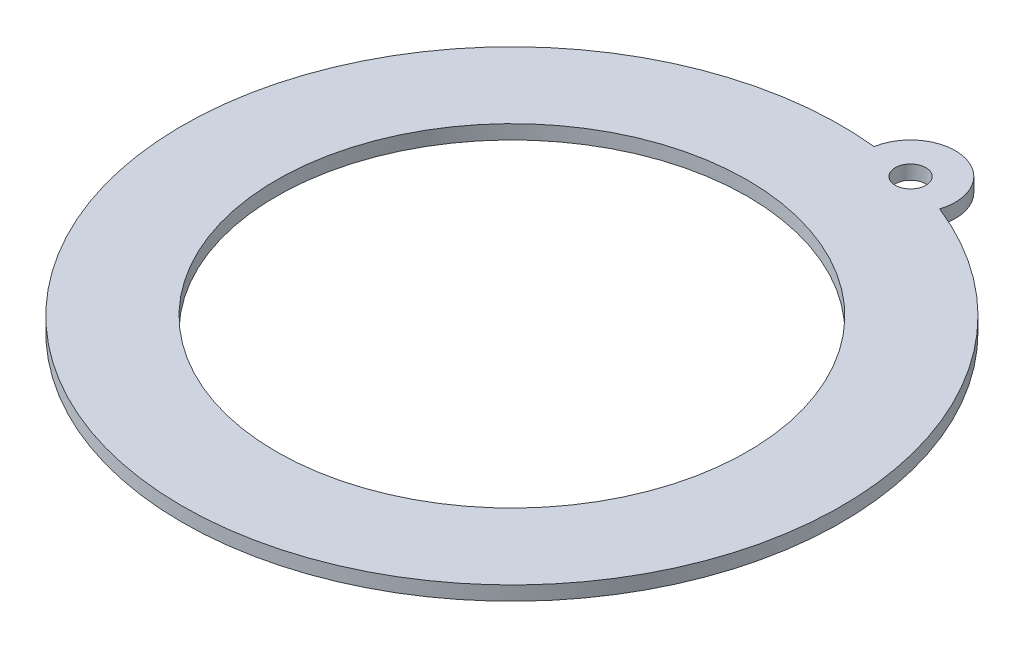
ISO-10303-21;
HEADER;
FILE_DESCRIPTION(('STEP AP214'),'2;1');
FILE_NAME('part.step','',(''),(''),'','','');
FILE_SCHEMA(('AUTOMOTIVE_DESIGN { 1 0 10303 214 1 1 1 1 }'));
ENDSEC;
DATA;
#1=APPLICATION_CONTEXT('core data for automotive mechanical design processes');
#2=APPLICATION_PROTOCOL_DEFINITION('international standard','automotive_design',2000,#1);
#3=PRODUCT_CONTEXT('',#1,'mechanical');
#4=PRODUCT('Part','Part','',(#3));
#5=PRODUCT_RELATED_PRODUCT_CATEGORY('part','',(#4));
#6=PRODUCT_DEFINITION_FORMATION('','',#4);
#7=PRODUCT_DEFINITION_CONTEXT('part definition',#1,'design');
#8=PRODUCT_DEFINITION('design','',#6,#7);
#9=PRODUCT_DEFINITION_SHAPE('','',#8);
#10=(LENGTH_UNIT() NAMED_UNIT(*) SI_UNIT(.MILLI.,.METRE.));
#11=(NAMED_UNIT(*) PLANE_ANGLE_UNIT() SI_UNIT($,.RADIAN.));
#12=(NAMED_UNIT(*) SI_UNIT($,.STERADIAN.) SOLID_ANGLE_UNIT());
#13=UNCERTAINTY_MEASURE_WITH_UNIT(LENGTH_MEASURE(1.E-05),#10,'distance_accuracy_value','');
#14=(GEOMETRIC_REPRESENTATION_CONTEXT(3) GLOBAL_UNCERTAINTY_ASSIGNED_CONTEXT((#13)) GLOBAL_UNIT_ASSIGNED_CONTEXT((#10,
#11,#12)) REPRESENTATION_CONTEXT('',''));
#15=CARTESIAN_POINT('',(0.,0.,0.));
#16=DIRECTION('',(0.,0.,1.));
#17=DIRECTION('',(1.,0.,0.));
#18=AXIS2_PLACEMENT_3D('',#15,#16,#17);
#19=CARTESIAN_POINT('',(8.34694195319569,3.,-33.9901244485804));
#20=DIRECTION('',(0.,-1.,0.));
#21=DIRECTION('',(0.,0.,-1.));
#22=AXIS2_PLACEMENT_3D('',#19,#20,#21);
#23=PLANE('',#22);
#24=CARTESIAN_POINT('',(16.6938839063914,3.,-67.9802488971608));
#25=DIRECTION('',(0.,1.,0.));
#26=DIRECTION('',(0.,0.,-1.));
#27=AXIS2_PLACEMENT_3D('',#24,#25,#26);
#28=CIRCLE('',#27,9.5);
#29=CARTESIAN_POINT('',(25.7447725463383,3.,-65.093829865336));
#30=VERTEX_POINT('',#29);
#31=CARTESIAN_POINT('',(7.33552118020941,3.,-69.6145827324613));
#32=VERTEX_POINT('',#31);
#33=EDGE_CURVE('E72',#30,#32,#28,.T.);
#34=ORIENTED_EDGE('',*,*,#33,.T.);
#35=CARTESIAN_POINT('',(0.,3.,0.));
#36=DIRECTION('',(0.,1.,0.));
#37=DIRECTION('',(0.,0.,1.));
#38=AXIS2_PLACEMENT_3D('',#35,#36,#37);
#39=CIRCLE('',#38,70.);
#40=EDGE_CURVE('E56',#32,#30,#39,.T.);
#41=ORIENTED_EDGE('',*,*,#40,.T.);
#42=EDGE_LOOP('',(#34,#41));
#43=FACE_BOUND('',#42,.T.);
#44=CARTESIAN_POINT('',(0.,3.,0.));
#45=DIRECTION('',(0.,1.,0.));
#46=DIRECTION('',(0.,0.,1.));
#47=AXIS2_PLACEMENT_3D('',#44,#45,#46);
#48=CIRCLE('',#47,50.);
#49=CARTESIAN_POINT('',(0.,3.,50.));
#50=VERTEX_POINT('',#49);
#51=EDGE_CURVE('E80',#50,#50,#48,.T.);
#52=ORIENTED_EDGE('',*,*,#51,.F.);
#53=EDGE_LOOP('',(#52));
#54=FACE_BOUND('',#53,.T.);
#55=CARTESIAN_POINT('',(16.6938839063914,3.,-67.9802488971608));
#56=DIRECTION('',(0.,1.,0.));
#57=DIRECTION('',(0.,0.,1.));
#58=AXIS2_PLACEMENT_3D('',#55,#56,#57);
#59=CIRCLE('',#58,3.25);
#60=CARTESIAN_POINT('',(16.6938839063914,3.,-64.7302488971608));
#61=VERTEX_POINT('',#60);
#62=EDGE_CURVE('E93',#61,#61,#59,.T.);
#63=ORIENTED_EDGE('',*,*,#62,.F.);
#64=EDGE_LOOP('',(#63));
#65=FACE_BOUND('',#64,.T.);
#66=ADVANCED_FACE('F39',(#43,#54,#65),#23,.F.);
#67=CARTESIAN_POINT('',(8.34694195319569,0.,-33.9901244485804));
#68=DIRECTION('',(0.,-1.,0.));
#69=DIRECTION('',(0.,0.,-1.));
#70=AXIS2_PLACEMENT_3D('',#67,#68,#69);
#71=PLANE('',#70);
#72=CARTESIAN_POINT('',(0.,0.,0.));
#73=DIRECTION('',(0.,1.,0.));
#74=DIRECTION('',(0.,0.,1.));
#75=AXIS2_PLACEMENT_3D('',#72,#73,#74);
#76=CIRCLE('',#75,50.);
#77=CARTESIAN_POINT('',(0.,0.,50.));
#78=VERTEX_POINT('',#77);
#79=EDGE_CURVE('E84',#78,#78,#76,.T.);
#80=ORIENTED_EDGE('',*,*,#79,.T.);
#81=EDGE_LOOP('',(#80));
#82=FACE_BOUND('',#81,.T.);
#83=CARTESIAN_POINT('',(16.6938839063914,0.,-67.9802488971608));
#84=DIRECTION('',(0.,1.,0.));
#85=DIRECTION('',(0.,0.,-1.));
#86=AXIS2_PLACEMENT_3D('',#83,#84,#85);
#87=CIRCLE('',#86,9.5);
#88=CARTESIAN_POINT('',(25.7447725463383,0.,-65.093829865336));
#89=VERTEX_POINT('',#88);
#90=CARTESIAN_POINT('',(7.33552118020941,0.,-69.6145827324613));
#91=VERTEX_POINT('',#90);
#92=EDGE_CURVE('E73',#89,#91,#87,.T.);
#93=ORIENTED_EDGE('',*,*,#92,.F.);
#94=CARTESIAN_POINT('',(0.,0.,0.));
#95=DIRECTION('',(0.,1.,0.));
#96=DIRECTION('',(0.,0.,1.));
#97=AXIS2_PLACEMENT_3D('',#94,#95,#96);
#98=CIRCLE('',#97,70.);
#99=EDGE_CURVE('E64',#91,#89,#98,.T.);
#100=ORIENTED_EDGE('',*,*,#99,.F.);
#101=EDGE_LOOP('',(#93,#100));
#102=FACE_BOUND('',#101,.T.);
#103=CARTESIAN_POINT('',(16.6938839063914,0.,-67.9802488971608));
#104=DIRECTION('',(0.,1.,0.));
#105=DIRECTION('',(0.,0.,1.));
#106=AXIS2_PLACEMENT_3D('',#103,#104,#105);
#107=CIRCLE('',#106,3.25);
#108=CARTESIAN_POINT('',(16.6938839063914,0.,-64.7302488971608));
#109=VERTEX_POINT('',#108);
#110=EDGE_CURVE('E95',#109,#109,#107,.T.);
#111=ORIENTED_EDGE('',*,*,#110,.T.);
#112=EDGE_LOOP('',(#111));
#113=FACE_BOUND('',#112,.T.);
#114=ADVANCED_FACE('F77',(#82,#102,#113),#71,.T.);
#115=CARTESIAN_POINT('',(16.6938839063914,3.,-67.9802488971608));
#116=DIRECTION('',(0.,-1.,0.));
#117=DIRECTION('',(0.,0.,-1.));
#118=AXIS2_PLACEMENT_3D('',#115,#116,#117);
#119=CYLINDRICAL_SURFACE('',#118,9.5);
#120=ORIENTED_EDGE('',*,*,#92,.T.);
#121=DIRECTION('',(0.,-1.,0.));
#122=VECTOR('',#121,1.);
#123=CARTESIAN_POINT('',(7.33552118020941,3.,-69.6145827324613));
#124=LINE('',#123,#122);
#125=EDGE_CURVE('E11',#32,#91,#124,.T.);
#126=ORIENTED_EDGE('',*,*,#125,.F.);
#127=ORIENTED_EDGE('',*,*,#33,.F.);
#128=DIRECTION('',(0.,-1.,0.));
#129=VECTOR('',#128,1.);
#130=CARTESIAN_POINT('',(25.7447725463383,3.,-65.093829865336));
#131=LINE('',#130,#129);
#132=EDGE_CURVE('E49',#30,#89,#131,.T.);
#133=ORIENTED_EDGE('',*,*,#132,.T.);
#134=EDGE_LOOP('',(#120,#126,#127,#133));
#135=FACE_BOUND('',#134,.T.);
#136=ADVANCED_FACE('F41',(#135),#119,.T.);
#137=CARTESIAN_POINT('',(0.,3.,0.));
#138=DIRECTION('',(0.,-1.,0.));
#139=DIRECTION('',(0.,0.,-1.));
#140=AXIS2_PLACEMENT_3D('',#137,#138,#139);
#141=CYLINDRICAL_SURFACE('',#140,70.);
#142=ORIENTED_EDGE('',*,*,#99,.T.);
#143=ORIENTED_EDGE('',*,*,#132,.F.);
#144=ORIENTED_EDGE('',*,*,#40,.F.);
#145=ORIENTED_EDGE('',*,*,#125,.T.);
#146=EDGE_LOOP('',(#142,#143,#144,#145));
#147=FACE_BOUND('',#146,.T.);
#148=ADVANCED_FACE('F67',(#147),#141,.T.);
#149=CARTESIAN_POINT('',(0.,3.,0.));
#150=DIRECTION('',(0.,-1.,0.));
#151=DIRECTION('',(0.,0.,-1.));
#152=AXIS2_PLACEMENT_3D('',#149,#150,#151);
#153=CYLINDRICAL_SURFACE('',#152,50.);
#154=ORIENTED_EDGE('',*,*,#51,.T.);
#155=EDGE_LOOP('',(#154));
#156=FACE_BOUND('',#155,.T.);
#157=ORIENTED_EDGE('',*,*,#79,.F.);
#158=EDGE_LOOP('',(#157));
#159=FACE_BOUND('',#158,.T.);
#160=ADVANCED_FACE('F115',(#156,#159),#153,.F.);
#161=CARTESIAN_POINT('',(16.6938839063914,3.,-67.9802488971608));
#162=DIRECTION('',(0.,-1.,0.));
#163=DIRECTION('',(0.,0.,-1.));
#164=AXIS2_PLACEMENT_3D('',#161,#162,#163);
#165=CYLINDRICAL_SURFACE('',#164,3.25);
#166=ORIENTED_EDGE('',*,*,#62,.T.);
#167=EDGE_LOOP('',(#166));
#168=FACE_BOUND('',#167,.T.);
#169=ORIENTED_EDGE('',*,*,#110,.F.);
#170=EDGE_LOOP('',(#169));
#171=FACE_BOUND('',#170,.T.);
#172=ADVANCED_FACE('F103',(#168,#171),#165,.F.);
#173=CLOSED_SHELL('',(#66,#114,#136,#148,#160,#172));
#174=MANIFOLD_SOLID_BREP('B2',#173);
#175=ADVANCED_BREP_SHAPE_REPRESENTATION('',(#18,#174),#14);
#176=SHAPE_DEFINITION_REPRESENTATION(#9,#175);
ENDSEC;
END-ISO-10303-21;
